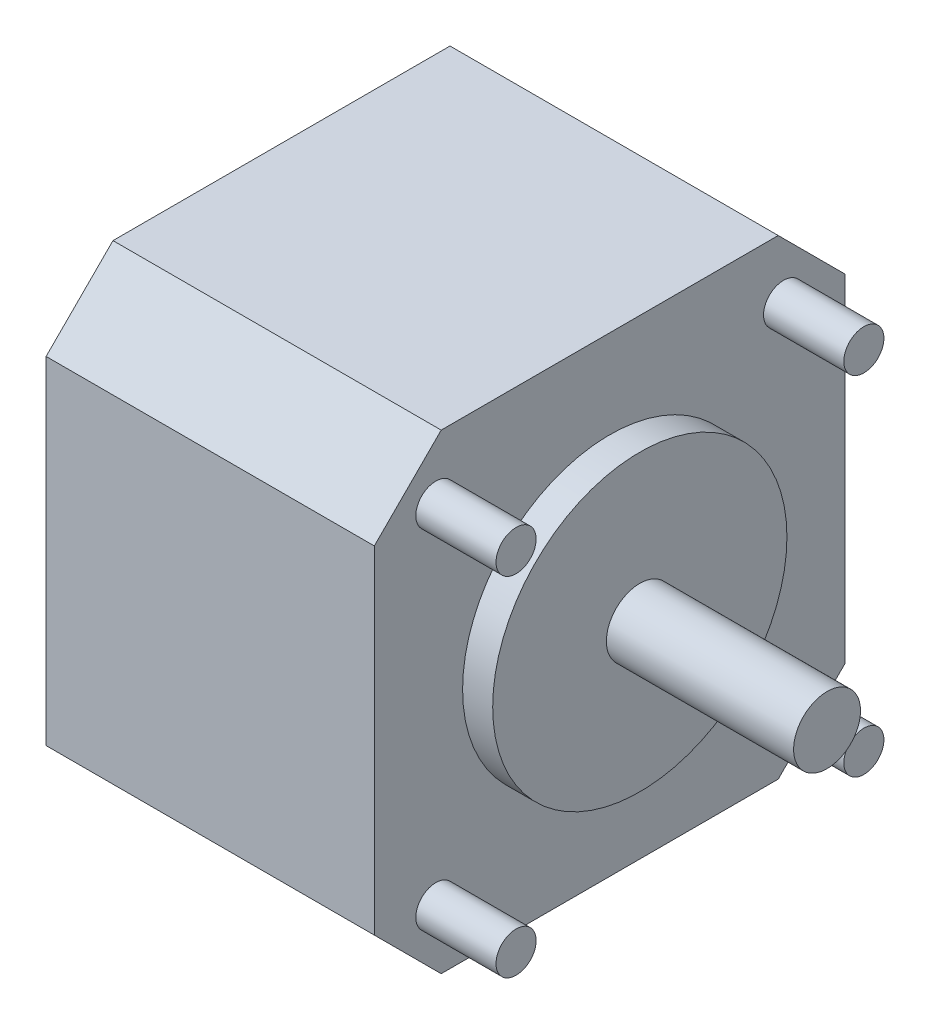
ISO-10303-21;
HEADER;
FILE_DESCRIPTION(('STEP AP214'),'2;1');
FILE_NAME('part.step','',(''),(''),'','','');
FILE_SCHEMA(('AUTOMOTIVE_DESIGN { 1 0 10303 214 1 1 1 1 }'));
ENDSEC;
DATA;
#1=APPLICATION_CONTEXT('core data for automotive mechanical design processes');
#2=APPLICATION_PROTOCOL_DEFINITION('international standard','automotive_design',2000,#1);
#3=PRODUCT_CONTEXT('',#1,'mechanical');
#4=PRODUCT('Part','Part','',(#3));
#5=PRODUCT_RELATED_PRODUCT_CATEGORY('part','',(#4));
#6=PRODUCT_DEFINITION_FORMATION('','',#4);
#7=PRODUCT_DEFINITION_CONTEXT('part definition',#1,'design');
#8=PRODUCT_DEFINITION('design','',#6,#7);
#9=PRODUCT_DEFINITION_SHAPE('','',#8);
#10=(LENGTH_UNIT() NAMED_UNIT(*) SI_UNIT(.MILLI.,.METRE.));
#11=(NAMED_UNIT(*) PLANE_ANGLE_UNIT() SI_UNIT($,.RADIAN.));
#12=(NAMED_UNIT(*) SI_UNIT($,.STERADIAN.) SOLID_ANGLE_UNIT());
#13=UNCERTAINTY_MEASURE_WITH_UNIT(LENGTH_MEASURE(1.E-05),#10,'distance_accuracy_value','');
#14=(GEOMETRIC_REPRESENTATION_CONTEXT(3) GLOBAL_UNCERTAINTY_ASSIGNED_CONTEXT((#13)) GLOBAL_UNIT_ASSIGNED_CONTEXT((#10,
#11,#12)) REPRESENTATION_CONTEXT('',''));
#15=CARTESIAN_POINT('',(0.,0.,0.));
#16=DIRECTION('',(0.,0.,1.));
#17=DIRECTION('',(1.,0.,0.));
#18=AXIS2_PLACEMENT_3D('',#15,#16,#17);
#19=CARTESIAN_POINT('',(0.,35.2,0.));
#20=DIRECTION('',(1.,0.,0.));
#21=DIRECTION('',(0.,0.,-1.));
#22=AXIS2_PLACEMENT_3D('',#19,#20,#21);
#23=PLANE('',#22);
#24=DIRECTION('',(0.,-1.,0.));
#25=VECTOR('',#24,1.);
#26=CARTESIAN_POINT('',(0.,35.2,0.));
#27=LINE('',#26,#25);
#28=CARTESIAN_POINT('',(0.,30.2,0.));
#29=VERTEX_POINT('',#28);
#30=CARTESIAN_POINT('',(0.,5.,0.));
#31=VERTEX_POINT('',#30);
#32=EDGE_CURVE('E141',#29,#31,#27,.T.);
#33=ORIENTED_EDGE('',*,*,#32,.F.);
#34=DIRECTION('',(0.,-0.707106781186548,0.707106781186547));
#35=VECTOR('',#34,1.);
#36=CARTESIAN_POINT('',(0.,35.2,-5.));
#37=LINE('',#36,#35);
#38=CARTESIAN_POINT('',(0.,35.2,-5.));
#39=VERTEX_POINT('',#38);
#40=EDGE_CURVE('E120',#29,#39,#37,.F.);
#41=ORIENTED_EDGE('',*,*,#40,.T.);
#42=DIRECTION('',(0.,0.,1.));
#43=VECTOR('',#42,1.);
#44=CARTESIAN_POINT('',(0.,35.2,0.));
#45=LINE('',#44,#43);
#46=CARTESIAN_POINT('',(0.,35.2,-30.2));
#47=VERTEX_POINT('',#46);
#48=EDGE_CURVE('E111',#47,#39,#45,.T.);
#49=ORIENTED_EDGE('',*,*,#48,.F.);
#50=DIRECTION('',(0.,0.70710678118655,0.707106781186545));
#51=VECTOR('',#50,1.);
#52=CARTESIAN_POINT('',(0.,35.2,-30.2));
#53=LINE('',#52,#51);
#54=CARTESIAN_POINT('',(0.,30.2,-35.2));
#55=VERTEX_POINT('',#54);
#56=EDGE_CURVE('E56',#47,#55,#53,.F.);
#57=ORIENTED_EDGE('',*,*,#56,.T.);
#58=DIRECTION('',(0.,-1.,0.));
#59=VECTOR('',#58,1.);
#60=CARTESIAN_POINT('',(0.,35.2,-35.2));
#61=LINE('',#60,#59);
#62=CARTESIAN_POINT('',(0.,5.,-35.2));
#63=VERTEX_POINT('',#62);
#64=EDGE_CURVE('E123',#55,#63,#61,.T.);
#65=ORIENTED_EDGE('',*,*,#64,.T.);
#66=DIRECTION('',(0.,-0.707106781186547,0.707106781186548));
#67=VECTOR('',#66,1.);
#68=CARTESIAN_POINT('',(0.,5.,-35.2));
#69=LINE('',#68,#67);
#70=CARTESIAN_POINT('',(0.,0.,-30.2));
#71=VERTEX_POINT('',#70);
#72=EDGE_CURVE('E48',#63,#71,#69,.T.);
#73=ORIENTED_EDGE('',*,*,#72,.T.);
#74=DIRECTION('',(0.,0.,1.));
#75=VECTOR('',#74,1.);
#76=CARTESIAN_POINT('',(0.,0.,0.));
#77=LINE('',#76,#75);
#78=CARTESIAN_POINT('',(0.,0.,-5.00000000000002));
#79=VERTEX_POINT('',#78);
#80=EDGE_CURVE('E126',#71,#79,#77,.T.);
#81=ORIENTED_EDGE('',*,*,#80,.T.);
#82=DIRECTION('',(0.,0.707106781186547,0.707106781186549));
#83=VECTOR('',#82,1.);
#84=CARTESIAN_POINT('',(0.,5.,0.));
#85=LINE('',#84,#83);
#86=EDGE_CURVE('E160',#79,#31,#85,.T.);
#87=ORIENTED_EDGE('',*,*,#86,.T.);
#88=EDGE_LOOP('',(#33,#41,#49,#57,#65,#73,#81,#87));
#89=FACE_BOUND('',#88,.T.);
#90=ADVANCED_FACE('F33',(#89),#23,.F.);
#91=CARTESIAN_POINT('',(0.,35.2,0.));
#92=DIRECTION('',(0.,0.,-1.));
#93=DIRECTION('',(-1.,0.,0.));
#94=AXIS2_PLACEMENT_3D('',#91,#92,#93);
#95=PLANE('',#94);
#96=DIRECTION('',(0.,-1.,0.));
#97=VECTOR('',#96,1.);
#98=CARTESIAN_POINT('',(24.54,35.2,0.));
#99=LINE('',#98,#97);
#100=CARTESIAN_POINT('',(24.54,30.2,0.));
#101=VERTEX_POINT('',#100);
#102=CARTESIAN_POINT('',(24.54,5.,0.));
#103=VERTEX_POINT('',#102);
#104=EDGE_CURVE('E138',#101,#103,#99,.T.);
#105=ORIENTED_EDGE('',*,*,#104,.F.);
#106=DIRECTION('',(-1.,0.,0.));
#107=VECTOR('',#106,1.);
#108=CARTESIAN_POINT('',(0.,30.2,0.));
#109=LINE('',#108,#107);
#110=EDGE_CURVE('E104',#101,#29,#109,.T.);
#111=ORIENTED_EDGE('',*,*,#110,.T.);
#112=ORIENTED_EDGE('',*,*,#32,.T.);
#113=DIRECTION('',(1.,0.,0.));
#114=VECTOR('',#113,1.);
#115=CARTESIAN_POINT('',(24.54,5.,0.));
#116=LINE('',#115,#114);
#117=EDGE_CURVE('E155',#31,#103,#116,.T.);
#118=ORIENTED_EDGE('',*,*,#117,.T.);
#119=EDGE_LOOP('',(#105,#111,#112,#118));
#120=FACE_BOUND('',#119,.T.);
#121=ADVANCED_FACE('F184',(#120),#95,.F.);
#122=CARTESIAN_POINT('',(24.54,35.2,0.));
#123=DIRECTION('',(-1.,0.,0.));
#124=DIRECTION('',(0.,0.,1.));
#125=AXIS2_PLACEMENT_3D('',#122,#123,#124);
#126=PLANE('',#125);
#127=CARTESIAN_POINT('',(24.54,4.59999999999981,-4.59999999999999));
#128=DIRECTION('',(-1.,0.,0.));
#129=DIRECTION('',(0.,0.,1.));
#130=AXIS2_PLACEMENT_3D('',#127,#128,#129);
#131=CIRCLE('',#130,1.5);
#132=CARTESIAN_POINT('',(24.54,4.59999999999981,-3.09999999999998));
#133=VERTEX_POINT('',#132);
#134=EDGE_CURVE('E11',#133,#133,#131,.F.);
#135=ORIENTED_EDGE('',*,*,#134,.F.);
#136=EDGE_LOOP('',(#135));
#137=FACE_BOUND('',#136,.T.);
#138=CARTESIAN_POINT('',(24.54,30.5999999999998,-4.59999999999999));
#139=DIRECTION('',(-1.,0.,0.));
#140=DIRECTION('',(0.,0.,1.));
#141=AXIS2_PLACEMENT_3D('',#138,#139,#140);
#142=CIRCLE('',#141,1.5);
#143=CARTESIAN_POINT('',(24.54,30.5999999999998,-3.09999999999998));
#144=VERTEX_POINT('',#143);
#145=EDGE_CURVE('E41',#144,#144,#142,.F.);
#146=ORIENTED_EDGE('',*,*,#145,.F.);
#147=EDGE_LOOP('',(#146));
#148=FACE_BOUND('',#147,.T.);
#149=CARTESIAN_POINT('',(24.54,4.59999999999999,-30.6));
#150=DIRECTION('',(-1.,0.,0.));
#151=DIRECTION('',(0.,0.,1.));
#152=AXIS2_PLACEMENT_3D('',#149,#150,#151);
#153=CIRCLE('',#152,1.50000000000001);
#154=CARTESIAN_POINT('',(24.54,4.59999999999999,-29.1));
#155=VERTEX_POINT('',#154);
#156=EDGE_CURVE('E173',#155,#155,#153,.F.);
#157=ORIENTED_EDGE('',*,*,#156,.F.);
#158=EDGE_LOOP('',(#157));
#159=FACE_BOUND('',#158,.T.);
#160=CARTESIAN_POINT('',(24.54,30.6,-30.6));
#161=DIRECTION('',(-1.,0.,0.));
#162=DIRECTION('',(0.,0.,1.));
#163=AXIS2_PLACEMENT_3D('',#160,#161,#162);
#164=CIRCLE('',#163,1.50000000000001);
#165=CARTESIAN_POINT('',(24.54,30.6,-29.1));
#166=VERTEX_POINT('',#165);
#167=EDGE_CURVE('E170',#166,#166,#164,.F.);
#168=ORIENTED_EDGE('',*,*,#167,.F.);
#169=EDGE_LOOP('',(#168));
#170=FACE_BOUND('',#169,.T.);
#171=CARTESIAN_POINT('',(24.54,17.6,-17.6));
#172=DIRECTION('',(-1.,0.,0.));
#173=DIRECTION('',(0.,0.,1.));
#174=AXIS2_PLACEMENT_3D('',#171,#172,#173);
#175=CIRCLE('',#174,11.);
#176=CARTESIAN_POINT('',(24.54,17.6,-6.6));
#177=VERTEX_POINT('',#176);
#178=EDGE_CURVE('E116',#177,#177,#175,.F.);
#179=ORIENTED_EDGE('',*,*,#178,.F.);
#180=EDGE_LOOP('',(#179));
#181=FACE_BOUND('',#180,.T.);
#182=DIRECTION('',(0.,0.,-1.));
#183=VECTOR('',#182,1.);
#184=CARTESIAN_POINT('',(24.54,35.2,0.));
#185=LINE('',#184,#183);
#186=CARTESIAN_POINT('',(24.54,35.2,-5.));
#187=VERTEX_POINT('',#186);
#188=CARTESIAN_POINT('',(24.54,35.2,-30.2));
#189=VERTEX_POINT('',#188);
#190=EDGE_CURVE('E114',#187,#189,#185,.T.);
#191=ORIENTED_EDGE('',*,*,#190,.F.);
#192=DIRECTION('',(0.,0.707106781186548,-0.707106781186547));
#193=VECTOR('',#192,1.);
#194=CARTESIAN_POINT('',(24.54,35.2,-5.00000000000001));
#195=LINE('',#194,#193);
#196=EDGE_CURVE('E153',#187,#101,#195,.F.);
#197=ORIENTED_EDGE('',*,*,#196,.T.);
#198=ORIENTED_EDGE('',*,*,#104,.T.);
#199=DIRECTION('',(0.,-0.707106781186547,-0.707106781186549));
#200=VECTOR('',#199,1.);
#201=CARTESIAN_POINT('',(24.54,5.,0.));
#202=LINE('',#201,#200);
#203=CARTESIAN_POINT('',(24.54,0.,-5.00000000000002));
#204=VERTEX_POINT('',#203);
#205=EDGE_CURVE('E151',#103,#204,#202,.T.);
#206=ORIENTED_EDGE('',*,*,#205,.T.);
#207=DIRECTION('',(0.,0.,-1.));
#208=VECTOR('',#207,1.);
#209=CARTESIAN_POINT('',(24.54,0.,0.));
#210=LINE('',#209,#208);
#211=CARTESIAN_POINT('',(24.54,0.,-30.2));
#212=VERTEX_POINT('',#211);
#213=EDGE_CURVE('E121',#204,#212,#210,.T.);
#214=ORIENTED_EDGE('',*,*,#213,.T.);
#215=DIRECTION('',(0.,0.707106781186547,-0.707106781186548));
#216=VECTOR('',#215,1.);
#217=CARTESIAN_POINT('',(24.54,5.00000000000001,-35.2));
#218=LINE('',#217,#216);
#219=CARTESIAN_POINT('',(24.54,5.,-35.2));
#220=VERTEX_POINT('',#219);
#221=EDGE_CURVE('E149',#212,#220,#218,.T.);
#222=ORIENTED_EDGE('',*,*,#221,.T.);
#223=DIRECTION('',(0.,-1.,0.));
#224=VECTOR('',#223,1.);
#225=CARTESIAN_POINT('',(24.54,35.2,-35.2));
#226=LINE('',#225,#224);
#227=CARTESIAN_POINT('',(24.54,30.2,-35.2));
#228=VERTEX_POINT('',#227);
#229=EDGE_CURVE('E135',#228,#220,#226,.T.);
#230=ORIENTED_EDGE('',*,*,#229,.F.);
#231=DIRECTION('',(0.,-0.70710678118655,-0.707106781186545));
#232=VECTOR('',#231,1.);
#233=CARTESIAN_POINT('',(24.54,35.2,-30.2));
#234=LINE('',#233,#232);
#235=EDGE_CURVE('E147',#228,#189,#234,.F.);
#236=ORIENTED_EDGE('',*,*,#235,.T.);
#237=EDGE_LOOP('',(#191,#197,#198,#206,#214,#222,#230,#236));
#238=FACE_BOUND('',#237,.T.);
#239=ADVANCED_FACE('F180',(#137,#148,#159,#170,#181,#238),#126,.F.);
#240=CARTESIAN_POINT('',(0.,35.2,-35.2));
#241=DIRECTION('',(0.,0.,1.));
#242=DIRECTION('',(1.,0.,0.));
#243=AXIS2_PLACEMENT_3D('',#240,#241,#242);
#244=PLANE('',#243);
#245=ORIENTED_EDGE('',*,*,#229,.T.);
#246=DIRECTION('',(-1.,0.,0.));
#247=VECTOR('',#246,1.);
#248=CARTESIAN_POINT('',(0.,5.,-35.2));
#249=LINE('',#248,#247);
#250=EDGE_CURVE('E168',#220,#63,#249,.T.);
#251=ORIENTED_EDGE('',*,*,#250,.T.);
#252=ORIENTED_EDGE('',*,*,#64,.F.);
#253=DIRECTION('',(1.,0.,0.));
#254=VECTOR('',#253,1.);
#255=CARTESIAN_POINT('',(0.,30.2,-35.2));
#256=LINE('',#255,#254);
#257=EDGE_CURVE('E103',#55,#228,#256,.T.);
#258=ORIENTED_EDGE('',*,*,#257,.T.);
#259=EDGE_LOOP('',(#245,#251,#252,#258));
#260=FACE_BOUND('',#259,.T.);
#261=ADVANCED_FACE('F183',(#260),#244,.F.);
#262=CARTESIAN_POINT('',(0.,35.2,0.));
#263=DIRECTION('',(0.,-1.,0.));
#264=DIRECTION('',(0.,0.,-1.));
#265=AXIS2_PLACEMENT_3D('',#262,#263,#264);
#266=PLANE('',#265);
#267=ORIENTED_EDGE('',*,*,#48,.T.);
#268=DIRECTION('',(1.,0.,0.));
#269=VECTOR('',#268,1.);
#270=CARTESIAN_POINT('',(0.,35.2,-5.));
#271=LINE('',#270,#269);
#272=EDGE_CURVE('E115',#39,#187,#271,.T.);
#273=ORIENTED_EDGE('',*,*,#272,.T.);
#274=ORIENTED_EDGE('',*,*,#190,.T.);
#275=DIRECTION('',(-1.,0.,0.));
#276=VECTOR('',#275,1.);
#277=CARTESIAN_POINT('',(0.,35.2,-30.2));
#278=LINE('',#277,#276);
#279=EDGE_CURVE('E102',#189,#47,#278,.T.);
#280=ORIENTED_EDGE('',*,*,#279,.T.);
#281=EDGE_LOOP('',(#267,#273,#274,#280));
#282=FACE_BOUND('',#281,.T.);
#283=ADVANCED_FACE('F109',(#282),#266,.F.);
#284=CARTESIAN_POINT('',(0.,0.,0.));
#285=DIRECTION('',(0.,-1.,0.));
#286=DIRECTION('',(0.,0.,-1.));
#287=AXIS2_PLACEMENT_3D('',#284,#285,#286);
#288=PLANE('',#287);
#289=ORIENTED_EDGE('',*,*,#213,.F.);
#290=DIRECTION('',(-1.,0.,0.));
#291=VECTOR('',#290,1.);
#292=CARTESIAN_POINT('',(0.,0.,-5.00000000000002));
#293=LINE('',#292,#291);
#294=EDGE_CURVE('E165',#204,#79,#293,.T.);
#295=ORIENTED_EDGE('',*,*,#294,.T.);
#296=ORIENTED_EDGE('',*,*,#80,.F.);
#297=DIRECTION('',(1.,0.,0.));
#298=VECTOR('',#297,1.);
#299=CARTESIAN_POINT('',(24.54,0.,-30.2));
#300=LINE('',#299,#298);
#301=EDGE_CURVE('E163',#71,#212,#300,.T.);
#302=ORIENTED_EDGE('',*,*,#301,.T.);
#303=EDGE_LOOP('',(#289,#295,#296,#302));
#304=FACE_BOUND('',#303,.T.);
#305=ADVANCED_FACE('F201',(#304),#288,.T.);
#306=CARTESIAN_POINT('',(26.79,17.6,-17.6));
#307=DIRECTION('',(-1.,0.,0.));
#308=DIRECTION('',(0.,0.,1.));
#309=AXIS2_PLACEMENT_3D('',#306,#307,#308);
#310=CYLINDRICAL_SURFACE('',#309,11.);
#311=CARTESIAN_POINT('',(26.79,17.6,-17.6));
#312=DIRECTION('',(1.,0.,0.));
#313=DIRECTION('',(0.,0.,-1.));
#314=AXIS2_PLACEMENT_3D('',#311,#312,#313);
#315=CIRCLE('',#314,11.);
#316=CARTESIAN_POINT('',(26.79,17.6,-28.6));
#317=VERTEX_POINT('',#316);
#318=EDGE_CURVE('E129',#317,#317,#315,.T.);
#319=ORIENTED_EDGE('',*,*,#318,.F.);
#320=EDGE_LOOP('',(#319));
#321=FACE_BOUND('',#320,.T.);
#322=ORIENTED_EDGE('',*,*,#178,.T.);
#323=EDGE_LOOP('',(#322));
#324=FACE_BOUND('',#323,.T.);
#325=ADVANCED_FACE('F233',(#321,#324),#310,.T.);
#326=CARTESIAN_POINT('',(26.79,17.6,-17.6));
#327=DIRECTION('',(1.,0.,0.));
#328=DIRECTION('',(0.,0.,-1.));
#329=AXIS2_PLACEMENT_3D('',#326,#327,#328);
#330=PLANE('',#329);
#331=CARTESIAN_POINT('',(26.79,17.6,-17.6));
#332=DIRECTION('',(1.,0.,0.));
#333=DIRECTION('',(0.,0.,-1.));
#334=AXIS2_PLACEMENT_3D('',#331,#332,#333);
#335=CIRCLE('',#334,2.5);
#336=CARTESIAN_POINT('',(26.79,17.6,-20.1));
#337=VERTEX_POINT('',#336);
#338=EDGE_CURVE('E292',#337,#337,#335,.T.);
#339=ORIENTED_EDGE('',*,*,#338,.F.);
#340=EDGE_LOOP('',(#339));
#341=FACE_BOUND('',#340,.T.);
#342=ORIENTED_EDGE('',*,*,#318,.T.);
#343=EDGE_LOOP('',(#342));
#344=FACE_BOUND('',#343,.T.);
#345=ADVANCED_FACE('F238',(#341,#344),#330,.T.);
#346=CARTESIAN_POINT('',(40.79,17.6,-17.6));
#347=DIRECTION('',(-1.,0.,0.));
#348=DIRECTION('',(0.,0.,1.));
#349=AXIS2_PLACEMENT_3D('',#346,#347,#348);
#350=CYLINDRICAL_SURFACE('',#349,2.5);
#351=CARTESIAN_POINT('',(40.79,17.6,-17.6));
#352=DIRECTION('',(1.,0.,0.));
#353=DIRECTION('',(0.,0.,-1.));
#354=AXIS2_PLACEMENT_3D('',#351,#352,#353);
#355=CIRCLE('',#354,2.5);
#356=CARTESIAN_POINT('',(40.79,17.6,-20.1));
#357=VERTEX_POINT('',#356);
#358=EDGE_CURVE('E293',#357,#357,#355,.T.);
#359=ORIENTED_EDGE('',*,*,#358,.F.);
#360=EDGE_LOOP('',(#359));
#361=FACE_BOUND('',#360,.T.);
#362=ORIENTED_EDGE('',*,*,#338,.T.);
#363=EDGE_LOOP('',(#362));
#364=FACE_BOUND('',#363,.T.);
#365=ADVANCED_FACE('F219',(#361,#364),#350,.T.);
#366=CARTESIAN_POINT('',(40.79,17.6,-17.6));
#367=DIRECTION('',(1.,0.,0.));
#368=DIRECTION('',(0.,0.,-1.));
#369=AXIS2_PLACEMENT_3D('',#366,#367,#368);
#370=PLANE('',#369);
#371=ORIENTED_EDGE('',*,*,#358,.T.);
#372=EDGE_LOOP('',(#371));
#373=FACE_BOUND('',#372,.T.);
#374=ADVANCED_FACE('F212',(#373),#370,.T.);
#375=CARTESIAN_POINT('',(0.,35.2,-5.));
#376=DIRECTION('',(0.,-0.707106781186547,-0.707106781186548));
#377=DIRECTION('',(1.,0.,0.));
#378=AXIS2_PLACEMENT_3D('',#375,#376,#377);
#379=PLANE('',#378);
#380=ORIENTED_EDGE('',*,*,#40,.F.);
#381=ORIENTED_EDGE('',*,*,#110,.F.);
#382=ORIENTED_EDGE('',*,*,#196,.F.);
#383=ORIENTED_EDGE('',*,*,#272,.F.);
#384=EDGE_LOOP('',(#380,#381,#382,#383));
#385=FACE_BOUND('',#384,.T.);
#386=ADVANCED_FACE('F210',(#385),#379,.F.);
#387=CARTESIAN_POINT('',(0.,5.,0.));
#388=DIRECTION('',(0.,-0.707106781186549,0.707106781186547));
#389=DIRECTION('',(-1.,0.,0.));
#390=AXIS2_PLACEMENT_3D('',#387,#388,#389);
#391=PLANE('',#390);
#392=ORIENTED_EDGE('',*,*,#86,.F.);
#393=ORIENTED_EDGE('',*,*,#294,.F.);
#394=ORIENTED_EDGE('',*,*,#205,.F.);
#395=ORIENTED_EDGE('',*,*,#117,.F.);
#396=EDGE_LOOP('',(#392,#393,#394,#395));
#397=FACE_BOUND('',#396,.T.);
#398=ADVANCED_FACE('F206',(#397),#391,.T.);
#399=CARTESIAN_POINT('',(0.,5.,-35.2));
#400=DIRECTION('',(0.,-0.707106781186548,-0.707106781186547));
#401=DIRECTION('',(1.,0.,0.));
#402=AXIS2_PLACEMENT_3D('',#399,#400,#401);
#403=PLANE('',#402);
#404=ORIENTED_EDGE('',*,*,#221,.F.);
#405=ORIENTED_EDGE('',*,*,#301,.F.);
#406=ORIENTED_EDGE('',*,*,#72,.F.);
#407=ORIENTED_EDGE('',*,*,#250,.F.);
#408=EDGE_LOOP('',(#404,#405,#406,#407));
#409=FACE_BOUND('',#408,.T.);
#410=ADVANCED_FACE('F197',(#409),#403,.T.);
#411=CARTESIAN_POINT('',(0.,35.2,-30.2));
#412=DIRECTION('',(0.,-0.707106781186545,0.70710678118655));
#413=DIRECTION('',(-1.,0.,0.));
#414=AXIS2_PLACEMENT_3D('',#411,#412,#413);
#415=PLANE('',#414);
#416=ORIENTED_EDGE('',*,*,#235,.F.);
#417=ORIENTED_EDGE('',*,*,#257,.F.);
#418=ORIENTED_EDGE('',*,*,#56,.F.);
#419=ORIENTED_EDGE('',*,*,#279,.F.);
#420=EDGE_LOOP('',(#416,#417,#418,#419));
#421=FACE_BOUND('',#420,.T.);
#422=ADVANCED_FACE('F35',(#421),#415,.F.);
#423=CARTESIAN_POINT('',(30.54,30.6,-30.6));
#424=DIRECTION('',(-1.,0.,0.));
#425=DIRECTION('',(0.,0.,1.));
#426=AXIS2_PLACEMENT_3D('',#423,#424,#425);
#427=CYLINDRICAL_SURFACE('',#426,1.50000000000001);
#428=CARTESIAN_POINT('',(30.54,30.6,-30.6));
#429=DIRECTION('',(1.,0.,0.));
#430=DIRECTION('',(0.,0.,-1.));
#431=AXIS2_PLACEMENT_3D('',#428,#429,#430);
#432=CIRCLE('',#431,1.50000000000001);
#433=CARTESIAN_POINT('',(30.54,30.6,-32.1));
#434=VERTEX_POINT('',#433);
#435=EDGE_CURVE('E289',#434,#434,#432,.T.);
#436=ORIENTED_EDGE('',*,*,#435,.F.);
#437=EDGE_LOOP('',(#436));
#438=FACE_BOUND('',#437,.T.);
#439=ORIENTED_EDGE('',*,*,#167,.T.);
#440=EDGE_LOOP('',(#439));
#441=FACE_BOUND('',#440,.T.);
#442=ADVANCED_FACE('F246',(#438,#441),#427,.T.);
#443=CARTESIAN_POINT('',(30.54,30.6,-30.6));
#444=DIRECTION('',(1.,0.,0.));
#445=DIRECTION('',(0.,0.,-1.));
#446=AXIS2_PLACEMENT_3D('',#443,#444,#445);
#447=PLANE('',#446);
#448=ORIENTED_EDGE('',*,*,#435,.T.);
#449=EDGE_LOOP('',(#448));
#450=FACE_BOUND('',#449,.T.);
#451=ADVANCED_FACE('F249',(#450),#447,.T.);
#452=CARTESIAN_POINT('',(30.54,4.59999999999999,-30.6));
#453=DIRECTION('',(-1.,0.,0.));
#454=DIRECTION('',(0.,0.,1.));
#455=AXIS2_PLACEMENT_3D('',#452,#453,#454);
#456=CYLINDRICAL_SURFACE('',#455,1.50000000000001);
#457=CARTESIAN_POINT('',(30.54,4.59999999999999,-30.6));
#458=DIRECTION('',(1.,0.,0.));
#459=DIRECTION('',(0.,0.,-1.));
#460=AXIS2_PLACEMENT_3D('',#457,#458,#459);
#461=CIRCLE('',#460,1.50000000000001);
#462=CARTESIAN_POINT('',(30.54,4.59999999999999,-32.1));
#463=VERTEX_POINT('',#462);
#464=EDGE_CURVE('E284',#463,#463,#461,.T.);
#465=ORIENTED_EDGE('',*,*,#464,.F.);
#466=EDGE_LOOP('',(#465));
#467=FACE_BOUND('',#466,.T.);
#468=ORIENTED_EDGE('',*,*,#156,.T.);
#469=EDGE_LOOP('',(#468));
#470=FACE_BOUND('',#469,.T.);
#471=ADVANCED_FACE('F253',(#467,#470),#456,.T.);
#472=CARTESIAN_POINT('',(30.54,4.59999999999999,-30.6));
#473=DIRECTION('',(1.,0.,0.));
#474=DIRECTION('',(0.,0.,-1.));
#475=AXIS2_PLACEMENT_3D('',#472,#473,#474);
#476=PLANE('',#475);
#477=ORIENTED_EDGE('',*,*,#464,.T.);
#478=EDGE_LOOP('',(#477));
#479=FACE_BOUND('',#478,.T.);
#480=ADVANCED_FACE('F257',(#479),#476,.T.);
#481=CARTESIAN_POINT('',(30.54,30.5999999999998,-4.59999999999999));
#482=DIRECTION('',(-1.,0.,0.));
#483=DIRECTION('',(0.,0.,1.));
#484=AXIS2_PLACEMENT_3D('',#481,#482,#483);
#485=CYLINDRICAL_SURFACE('',#484,1.5);
#486=CARTESIAN_POINT('',(30.54,30.5999999999998,-4.59999999999999));
#487=DIRECTION('',(1.,0.,0.));
#488=DIRECTION('',(0.,0.,-1.));
#489=AXIS2_PLACEMENT_3D('',#486,#487,#488);
#490=CIRCLE('',#489,1.5);
#491=CARTESIAN_POINT('',(30.54,30.5999999999998,-6.09999999999999));
#492=VERTEX_POINT('',#491);
#493=EDGE_CURVE('E281',#492,#492,#490,.T.);
#494=ORIENTED_EDGE('',*,*,#493,.F.);
#495=EDGE_LOOP('',(#494));
#496=FACE_BOUND('',#495,.T.);
#497=ORIENTED_EDGE('',*,*,#145,.T.);
#498=EDGE_LOOP('',(#497));
#499=FACE_BOUND('',#498,.T.);
#500=ADVANCED_FACE('F178',(#496,#499),#485,.T.);
#501=CARTESIAN_POINT('',(30.54,30.5999999999998,-4.59999999999999));
#502=DIRECTION('',(1.,0.,0.));
#503=DIRECTION('',(0.,0.,-1.));
#504=AXIS2_PLACEMENT_3D('',#501,#502,#503);
#505=PLANE('',#504);
#506=ORIENTED_EDGE('',*,*,#493,.T.);
#507=EDGE_LOOP('',(#506));
#508=FACE_BOUND('',#507,.T.);
#509=ADVANCED_FACE('F264',(#508),#505,.T.);
#510=CARTESIAN_POINT('',(30.54,4.59999999999981,-4.59999999999999));
#511=DIRECTION('',(-1.,0.,0.));
#512=DIRECTION('',(0.,0.,1.));
#513=AXIS2_PLACEMENT_3D('',#510,#511,#512);
#514=CYLINDRICAL_SURFACE('',#513,1.5);
#515=CARTESIAN_POINT('',(30.54,4.59999999999981,-4.59999999999999));
#516=DIRECTION('',(1.,0.,0.));
#517=DIRECTION('',(0.,0.,-1.));
#518=AXIS2_PLACEMENT_3D('',#515,#516,#517);
#519=CIRCLE('',#518,1.5);
#520=CARTESIAN_POINT('',(30.54,4.59999999999981,-6.09999999999999));
#521=VERTEX_POINT('',#520);
#522=EDGE_CURVE('E280',#521,#521,#519,.T.);
#523=ORIENTED_EDGE('',*,*,#522,.F.);
#524=EDGE_LOOP('',(#523));
#525=FACE_BOUND('',#524,.T.);
#526=ORIENTED_EDGE('',*,*,#134,.T.);
#527=EDGE_LOOP('',(#526));
#528=FACE_BOUND('',#527,.T.);
#529=ADVANCED_FACE('F268',(#525,#528),#514,.T.);
#530=CARTESIAN_POINT('',(30.54,4.59999999999981,-4.59999999999999));
#531=DIRECTION('',(1.,0.,0.));
#532=DIRECTION('',(0.,0.,-1.));
#533=AXIS2_PLACEMENT_3D('',#530,#531,#532);
#534=PLANE('',#533);
#535=ORIENTED_EDGE('',*,*,#522,.T.);
#536=EDGE_LOOP('',(#535));
#537=FACE_BOUND('',#536,.T.);
#538=ADVANCED_FACE('F272',(#537),#534,.T.);
#539=CLOSED_SHELL('',(#90,#121,#239,#261,#283,#305,#325,#345,#365,#374,#386,#398,#410,#422,#442,
#451,#471,#480,#500,#509,#529,#538));
#540=MANIFOLD_SOLID_BREP('B2',#539);
#541=ADVANCED_BREP_SHAPE_REPRESENTATION('',(#18,#540),#14);
#542=SHAPE_DEFINITION_REPRESENTATION(#9,#541);
ENDSEC;
END-ISO-10303-21;
